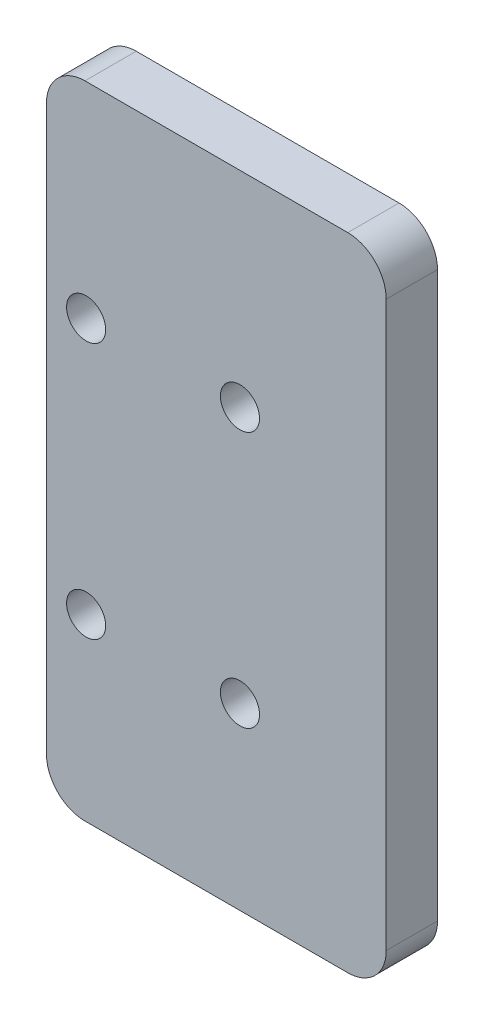
ISO-10303-21;
HEADER;
FILE_DESCRIPTION(('STEP AP214'),'2;1');
FILE_NAME('part.step','',(''),(''),'','','');
FILE_SCHEMA(('AUTOMOTIVE_DESIGN { 1 0 10303 214 1 1 1 1 }'));
ENDSEC;
DATA;
#1=APPLICATION_CONTEXT('core data for automotive mechanical design processes');
#2=APPLICATION_PROTOCOL_DEFINITION('international standard','automotive_design',2000,#1);
#3=PRODUCT_CONTEXT('',#1,'mechanical');
#4=PRODUCT('Part','Part','',(#3));
#5=PRODUCT_RELATED_PRODUCT_CATEGORY('part','',(#4));
#6=PRODUCT_DEFINITION_FORMATION('','',#4);
#7=PRODUCT_DEFINITION_CONTEXT('part definition',#1,'design');
#8=PRODUCT_DEFINITION('design','',#6,#7);
#9=PRODUCT_DEFINITION_SHAPE('','',#8);
#10=(LENGTH_UNIT() NAMED_UNIT(*) SI_UNIT(.MILLI.,.METRE.));
#11=(NAMED_UNIT(*) PLANE_ANGLE_UNIT() SI_UNIT($,.RADIAN.));
#12=(NAMED_UNIT(*) SI_UNIT($,.STERADIAN.) SOLID_ANGLE_UNIT());
#13=UNCERTAINTY_MEASURE_WITH_UNIT(LENGTH_MEASURE(1.E-05),#10,'distance_accuracy_value','');
#14=(GEOMETRIC_REPRESENTATION_CONTEXT(3) GLOBAL_UNCERTAINTY_ASSIGNED_CONTEXT((#13)) GLOBAL_UNIT_ASSIGNED_CONTEXT((#10,
#11,#12)) REPRESENTATION_CONTEXT('',''));
#15=CARTESIAN_POINT('',(0.,0.,0.));
#16=DIRECTION('',(0.,0.,1.));
#17=DIRECTION('',(1.,0.,0.));
#18=AXIS2_PLACEMENT_3D('',#15,#16,#17);
#19=CARTESIAN_POINT('',(13.25,-25.,4.));
#20=DIRECTION('',(-1.,0.,0.));
#21=DIRECTION('',(0.,0.,1.));
#22=AXIS2_PLACEMENT_3D('',#19,#20,#21);
#23=PLANE('',#22);
#24=DIRECTION('',(0.,1.,0.));
#25=VECTOR('',#24,1.);
#26=CARTESIAN_POINT('',(13.25,-25.,4.));
#27=LINE('',#26,#25);
#28=CARTESIAN_POINT('',(13.25,-22.,4.));
#29=VERTEX_POINT('',#28);
#30=CARTESIAN_POINT('',(13.25,22.,4.));
#31=VERTEX_POINT('',#30);
#32=EDGE_CURVE('E121',#29,#31,#27,.T.);
#33=ORIENTED_EDGE('',*,*,#32,.F.);
#34=DIRECTION('',(0.,0.,-1.));
#35=VECTOR('',#34,1.);
#36=CARTESIAN_POINT('',(13.25,-22.,4.));
#37=LINE('',#36,#35);
#38=CARTESIAN_POINT('',(13.25,-22.,0.));
#39=VERTEX_POINT('',#38);
#40=EDGE_CURVE('E106',#29,#39,#37,.T.);
#41=ORIENTED_EDGE('',*,*,#40,.T.);
#42=DIRECTION('',(0.,1.,0.));
#43=VECTOR('',#42,1.);
#44=CARTESIAN_POINT('',(13.25,-25.,0.));
#45=LINE('',#44,#43);
#46=CARTESIAN_POINT('',(13.25,22.,0.));
#47=VERTEX_POINT('',#46);
#48=EDGE_CURVE('E118',#39,#47,#45,.T.);
#49=ORIENTED_EDGE('',*,*,#48,.T.);
#50=DIRECTION('',(0.,0.,-1.));
#51=VECTOR('',#50,1.);
#52=CARTESIAN_POINT('',(13.25,22.,4.));
#53=LINE('',#52,#51);
#54=EDGE_CURVE('E123',#47,#31,#53,.F.);
#55=ORIENTED_EDGE('',*,*,#54,.T.);
#56=EDGE_LOOP('',(#33,#41,#49,#55));
#57=FACE_BOUND('',#56,.T.);
#58=ADVANCED_FACE('F36',(#57),#23,.F.);
#59=CARTESIAN_POINT('',(-13.25,25.,4.));
#60=DIRECTION('',(0.,-1.,0.));
#61=DIRECTION('',(0.,0.,-1.));
#62=AXIS2_PLACEMENT_3D('',#59,#60,#61);
#63=PLANE('',#62);
#64=DIRECTION('',(-1.,0.,0.));
#65=VECTOR('',#64,1.);
#66=CARTESIAN_POINT('',(-13.25,25.,0.));
#67=LINE('',#66,#65);
#68=CARTESIAN_POINT('',(10.25,25.,0.));
#69=VERTEX_POINT('',#68);
#70=CARTESIAN_POINT('',(-10.25,25.,0.));
#71=VERTEX_POINT('',#70);
#72=EDGE_CURVE('E127',#69,#71,#67,.T.);
#73=ORIENTED_EDGE('',*,*,#72,.T.);
#74=DIRECTION('',(0.,0.,-1.));
#75=VECTOR('',#74,1.);
#76=CARTESIAN_POINT('',(-10.25,25.,4.));
#77=LINE('',#76,#75);
#78=CARTESIAN_POINT('',(-10.25,25.,4.));
#79=VERTEX_POINT('',#78);
#80=EDGE_CURVE('E11',#71,#79,#77,.F.);
#81=ORIENTED_EDGE('',*,*,#80,.T.);
#82=DIRECTION('',(-1.,0.,0.));
#83=VECTOR('',#82,1.);
#84=CARTESIAN_POINT('',(-13.25,25.,4.));
#85=LINE('',#84,#83);
#86=CARTESIAN_POINT('',(10.25,25.,4.));
#87=VERTEX_POINT('',#86);
#88=EDGE_CURVE('E167',#87,#79,#85,.T.);
#89=ORIENTED_EDGE('',*,*,#88,.F.);
#90=DIRECTION('',(0.,0.,-1.));
#91=VECTOR('',#90,1.);
#92=CARTESIAN_POINT('',(10.25,25.,4.));
#93=LINE('',#92,#91);
#94=EDGE_CURVE('E44',#87,#69,#93,.T.);
#95=ORIENTED_EDGE('',*,*,#94,.T.);
#96=EDGE_LOOP('',(#73,#81,#89,#95));
#97=FACE_BOUND('',#96,.T.);
#98=ADVANCED_FACE('F165',(#97),#63,.F.);
#99=CARTESIAN_POINT('',(-13.25,-25.,4.));
#100=DIRECTION('',(1.,0.,0.));
#101=DIRECTION('',(0.,0.,-1.));
#102=AXIS2_PLACEMENT_3D('',#99,#100,#101);
#103=PLANE('',#102);
#104=DIRECTION('',(0.,-1.,0.));
#105=VECTOR('',#104,1.);
#106=CARTESIAN_POINT('',(-13.25,-25.,0.));
#107=LINE('',#106,#105);
#108=CARTESIAN_POINT('',(-13.25,22.,0.));
#109=VERTEX_POINT('',#108);
#110=CARTESIAN_POINT('',(-13.25,-22.,0.));
#111=VERTEX_POINT('',#110);
#112=EDGE_CURVE('E131',#109,#111,#107,.T.);
#113=ORIENTED_EDGE('',*,*,#112,.T.);
#114=DIRECTION('',(0.,0.,-1.));
#115=VECTOR('',#114,1.);
#116=CARTESIAN_POINT('',(-13.25,-22.,4.));
#117=LINE('',#116,#115);
#118=CARTESIAN_POINT('',(-13.25,-22.,4.));
#119=VERTEX_POINT('',#118);
#120=EDGE_CURVE('E51',#111,#119,#117,.F.);
#121=ORIENTED_EDGE('',*,*,#120,.T.);
#122=DIRECTION('',(0.,-1.,0.));
#123=VECTOR('',#122,1.);
#124=CARTESIAN_POINT('',(-13.25,-25.,4.));
#125=LINE('',#124,#123);
#126=CARTESIAN_POINT('',(-13.25,22.,4.));
#127=VERTEX_POINT('',#126);
#128=EDGE_CURVE('E175',#127,#119,#125,.T.);
#129=ORIENTED_EDGE('',*,*,#128,.F.);
#130=DIRECTION('',(0.,0.,-1.));
#131=VECTOR('',#130,1.);
#132=CARTESIAN_POINT('',(-13.25,22.,4.));
#133=LINE('',#132,#131);
#134=EDGE_CURVE('E158',#127,#109,#133,.T.);
#135=ORIENTED_EDGE('',*,*,#134,.T.);
#136=EDGE_LOOP('',(#113,#121,#129,#135));
#137=FACE_BOUND('',#136,.T.);
#138=ADVANCED_FACE('F174',(#137),#103,.F.);
#139=CARTESIAN_POINT('',(-13.25,-25.,4.));
#140=DIRECTION('',(0.,1.,0.));
#141=DIRECTION('',(0.,0.,1.));
#142=AXIS2_PLACEMENT_3D('',#139,#140,#141);
#143=PLANE('',#142);
#144=DIRECTION('',(1.,0.,0.));
#145=VECTOR('',#144,1.);
#146=CARTESIAN_POINT('',(-13.25,-25.,0.));
#147=LINE('',#146,#145);
#148=CARTESIAN_POINT('',(-10.25,-25.,0.));
#149=VERTEX_POINT('',#148);
#150=CARTESIAN_POINT('',(10.25,-25.,0.));
#151=VERTEX_POINT('',#150);
#152=EDGE_CURVE('E141',#149,#151,#147,.T.);
#153=ORIENTED_EDGE('',*,*,#152,.T.);
#154=DIRECTION('',(0.,0.,-1.));
#155=VECTOR('',#154,1.);
#156=CARTESIAN_POINT('',(10.25,-25.,4.));
#157=LINE('',#156,#155);
#158=CARTESIAN_POINT('',(10.25,-25.,4.));
#159=VERTEX_POINT('',#158);
#160=EDGE_CURVE('E107',#151,#159,#157,.F.);
#161=ORIENTED_EDGE('',*,*,#160,.T.);
#162=DIRECTION('',(1.,0.,0.));
#163=VECTOR('',#162,1.);
#164=CARTESIAN_POINT('',(-13.25,-25.,4.));
#165=LINE('',#164,#163);
#166=CARTESIAN_POINT('',(-10.25,-25.,4.));
#167=VERTEX_POINT('',#166);
#168=EDGE_CURVE('E137',#167,#159,#165,.T.);
#169=ORIENTED_EDGE('',*,*,#168,.F.);
#170=DIRECTION('',(0.,0.,-1.));
#171=VECTOR('',#170,1.);
#172=CARTESIAN_POINT('',(-10.25,-25.,4.));
#173=LINE('',#172,#171);
#174=EDGE_CURVE('E112',#167,#149,#173,.T.);
#175=ORIENTED_EDGE('',*,*,#174,.T.);
#176=EDGE_LOOP('',(#153,#161,#169,#175));
#177=FACE_BOUND('',#176,.T.);
#178=ADVANCED_FACE('F215',(#177),#143,.F.);
#179=CARTESIAN_POINT('',(0.,0.,4.));
#180=DIRECTION('',(0.,0.,-1.));
#181=DIRECTION('',(-1.,0.,0.));
#182=AXIS2_PLACEMENT_3D('',#179,#180,#181);
#183=PLANE('',#182);
#184=CARTESIAN_POINT('',(1.84135955634475,8.99999999999956,4.));
#185=DIRECTION('',(0.,0.,1.));
#186=DIRECTION('',(1.,0.,0.));
#187=AXIS2_PLACEMENT_3D('',#184,#185,#186);
#188=CIRCLE('',#187,1.525);
#189=CARTESIAN_POINT('',(3.36635955634475,8.99999999999956,4.));
#190=VERTEX_POINT('',#189);
#191=EDGE_CURVE('E191',#190,#190,#188,.T.);
#192=ORIENTED_EDGE('',*,*,#191,.F.);
#193=EDGE_LOOP('',(#192));
#194=FACE_BOUND('',#193,.T.);
#195=CARTESIAN_POINT('',(-10.1586404436553,-11.0000000000004,4.));
#196=DIRECTION('',(0.,0.,1.));
#197=DIRECTION('',(1.,0.,0.));
#198=AXIS2_PLACEMENT_3D('',#195,#196,#197);
#199=CIRCLE('',#198,1.525);
#200=CARTESIAN_POINT('',(-8.63364044365525,-11.0000000000004,4.));
#201=VERTEX_POINT('',#200);
#202=EDGE_CURVE('E184',#201,#201,#199,.T.);
#203=ORIENTED_EDGE('',*,*,#202,.F.);
#204=EDGE_LOOP('',(#203));
#205=FACE_BOUND('',#204,.T.);
#206=CARTESIAN_POINT('',(1.84135955634475,-11.0000000000004,4.));
#207=DIRECTION('',(0.,0.,1.));
#208=DIRECTION('',(1.,0.,0.));
#209=AXIS2_PLACEMENT_3D('',#206,#207,#208);
#210=CIRCLE('',#209,1.525);
#211=CARTESIAN_POINT('',(3.36635955634475,-11.0000000000004,4.));
#212=VERTEX_POINT('',#211);
#213=EDGE_CURVE('E196',#212,#212,#210,.T.);
#214=ORIENTED_EDGE('',*,*,#213,.F.);
#215=EDGE_LOOP('',(#214));
#216=FACE_BOUND('',#215,.T.);
#217=CARTESIAN_POINT('',(-10.1586404436553,8.99999999999953,4.));
#218=DIRECTION('',(0.,0.,1.));
#219=DIRECTION('',(1.,0.,0.));
#220=AXIS2_PLACEMENT_3D('',#217,#218,#219);
#221=CIRCLE('',#220,1.525);
#222=CARTESIAN_POINT('',(-8.63364044365525,8.99999999999953,4.));
#223=VERTEX_POINT('',#222);
#224=EDGE_CURVE('E134',#223,#223,#221,.T.);
#225=ORIENTED_EDGE('',*,*,#224,.F.);
#226=EDGE_LOOP('',(#225));
#227=FACE_BOUND('',#226,.T.);
#228=ORIENTED_EDGE('',*,*,#168,.T.);
#229=CARTESIAN_POINT('',(10.25,-22.,4.));
#230=DIRECTION('',(0.,0.,-1.));
#231=DIRECTION('',(-1.,0.,0.));
#232=AXIS2_PLACEMENT_3D('',#229,#230,#231);
#233=CIRCLE('',#232,3.);
#234=EDGE_CURVE('E156',#159,#29,#233,.F.);
#235=ORIENTED_EDGE('',*,*,#234,.T.);
#236=ORIENTED_EDGE('',*,*,#32,.T.);
#237=CARTESIAN_POINT('',(10.25,22.,4.));
#238=DIRECTION('',(0.,0.,-1.));
#239=DIRECTION('',(-1.,0.,0.));
#240=AXIS2_PLACEMENT_3D('',#237,#238,#239);
#241=CIRCLE('',#240,3.);
#242=EDGE_CURVE('E151',#31,#87,#241,.F.);
#243=ORIENTED_EDGE('',*,*,#242,.T.);
#244=ORIENTED_EDGE('',*,*,#88,.T.);
#245=CARTESIAN_POINT('',(-10.25,22.,4.));
#246=DIRECTION('',(0.,0.,-1.));
#247=DIRECTION('',(-1.,0.,0.));
#248=AXIS2_PLACEMENT_3D('',#245,#246,#247);
#249=CIRCLE('',#248,3.);
#250=EDGE_CURVE('E58',#79,#127,#249,.F.);
#251=ORIENTED_EDGE('',*,*,#250,.T.);
#252=ORIENTED_EDGE('',*,*,#128,.T.);
#253=CARTESIAN_POINT('',(-10.25,-22.,4.));
#254=DIRECTION('',(0.,0.,-1.));
#255=DIRECTION('',(-1.,0.,0.));
#256=AXIS2_PLACEMENT_3D('',#253,#254,#255);
#257=CIRCLE('',#256,3.);
#258=EDGE_CURVE('E154',#119,#167,#257,.F.);
#259=ORIENTED_EDGE('',*,*,#258,.T.);
#260=EDGE_LOOP('',(#228,#235,#236,#243,#244,#251,#252,#259));
#261=FACE_BOUND('',#260,.T.);
#262=ADVANCED_FACE('F212',(#194,#205,#216,#227,#261),#183,.F.);
#263=CARTESIAN_POINT('',(0.,0.,0.));
#264=DIRECTION('',(0.,0.,-1.));
#265=DIRECTION('',(-1.,0.,0.));
#266=AXIS2_PLACEMENT_3D('',#263,#264,#265);
#267=PLANE('',#266);
#268=CARTESIAN_POINT('',(1.84135955634475,8.99999999999956,0.));
#269=DIRECTION('',(0.,0.,1.));
#270=DIRECTION('',(1.,0.,0.));
#271=AXIS2_PLACEMENT_3D('',#268,#269,#270);
#272=CIRCLE('',#271,1.525);
#273=CARTESIAN_POINT('',(3.36635955634475,8.99999999999956,0.));
#274=VERTEX_POINT('',#273);
#275=EDGE_CURVE('E182',#274,#274,#272,.T.);
#276=ORIENTED_EDGE('',*,*,#275,.T.);
#277=EDGE_LOOP('',(#276));
#278=FACE_BOUND('',#277,.T.);
#279=CARTESIAN_POINT('',(-10.1586404436553,-11.0000000000004,0.));
#280=DIRECTION('',(0.,0.,1.));
#281=DIRECTION('',(1.,0.,0.));
#282=AXIS2_PLACEMENT_3D('',#279,#280,#281);
#283=CIRCLE('',#282,1.525);
#284=CARTESIAN_POINT('',(-8.63364044365525,-11.0000000000004,0.));
#285=VERTEX_POINT('',#284);
#286=EDGE_CURVE('E187',#285,#285,#283,.T.);
#287=ORIENTED_EDGE('',*,*,#286,.T.);
#288=EDGE_LOOP('',(#287));
#289=FACE_BOUND('',#288,.T.);
#290=CARTESIAN_POINT('',(1.84135955634475,-11.0000000000004,0.));
#291=DIRECTION('',(0.,0.,1.));
#292=DIRECTION('',(1.,0.,0.));
#293=AXIS2_PLACEMENT_3D('',#290,#291,#292);
#294=CIRCLE('',#293,1.525);
#295=CARTESIAN_POINT('',(3.36635955634475,-11.0000000000004,0.));
#296=VERTEX_POINT('',#295);
#297=EDGE_CURVE('E188',#296,#296,#294,.T.);
#298=ORIENTED_EDGE('',*,*,#297,.T.);
#299=EDGE_LOOP('',(#298));
#300=FACE_BOUND('',#299,.T.);
#301=CARTESIAN_POINT('',(-10.1586404436553,8.99999999999953,0.));
#302=DIRECTION('',(0.,0.,1.));
#303=DIRECTION('',(1.,0.,0.));
#304=AXIS2_PLACEMENT_3D('',#301,#302,#303);
#305=CIRCLE('',#304,1.525);
#306=CARTESIAN_POINT('',(-8.63364044365525,8.99999999999953,0.));
#307=VERTEX_POINT('',#306);
#308=EDGE_CURVE('E128',#307,#307,#305,.T.);
#309=ORIENTED_EDGE('',*,*,#308,.T.);
#310=EDGE_LOOP('',(#309));
#311=FACE_BOUND('',#310,.T.);
#312=ORIENTED_EDGE('',*,*,#48,.F.);
#313=CARTESIAN_POINT('',(10.25,-22.,0.));
#314=DIRECTION('',(0.,0.,-1.));
#315=DIRECTION('',(-1.,0.,0.));
#316=AXIS2_PLACEMENT_3D('',#313,#314,#315);
#317=CIRCLE('',#316,3.);
#318=EDGE_CURVE('E102',#39,#151,#317,.T.);
#319=ORIENTED_EDGE('',*,*,#318,.T.);
#320=ORIENTED_EDGE('',*,*,#152,.F.);
#321=CARTESIAN_POINT('',(-10.25,-22.,0.));
#322=DIRECTION('',(0.,0.,-1.));
#323=DIRECTION('',(-1.,0.,0.));
#324=AXIS2_PLACEMENT_3D('',#321,#322,#323);
#325=CIRCLE('',#324,3.);
#326=EDGE_CURVE('E113',#149,#111,#325,.T.);
#327=ORIENTED_EDGE('',*,*,#326,.T.);
#328=ORIENTED_EDGE('',*,*,#112,.F.);
#329=CARTESIAN_POINT('',(-10.25,22.,0.));
#330=DIRECTION('',(0.,0.,-1.));
#331=DIRECTION('',(-1.,0.,0.));
#332=AXIS2_PLACEMENT_3D('',#329,#330,#331);
#333=CIRCLE('',#332,3.);
#334=EDGE_CURVE('E145',#109,#71,#333,.T.);
#335=ORIENTED_EDGE('',*,*,#334,.T.);
#336=ORIENTED_EDGE('',*,*,#72,.F.);
#337=CARTESIAN_POINT('',(10.25,22.,0.));
#338=DIRECTION('',(0.,0.,-1.));
#339=DIRECTION('',(-1.,0.,0.));
#340=AXIS2_PLACEMENT_3D('',#337,#338,#339);
#341=CIRCLE('',#340,3.);
#342=EDGE_CURVE('E122',#69,#47,#341,.T.);
#343=ORIENTED_EDGE('',*,*,#342,.T.);
#344=EDGE_LOOP('',(#312,#319,#320,#327,#328,#335,#336,#343));
#345=FACE_BOUND('',#344,.T.);
#346=ADVANCED_FACE('F125',(#278,#289,#300,#311,#345),#267,.T.);
#347=CARTESIAN_POINT('',(-10.1586404436553,8.99999999999953,0.));
#348=DIRECTION('',(0.,0.,1.));
#349=DIRECTION('',(1.,0.,0.));
#350=AXIS2_PLACEMENT_3D('',#347,#348,#349);
#351=CYLINDRICAL_SURFACE('',#350,1.525);
#352=ORIENTED_EDGE('',*,*,#308,.F.);
#353=EDGE_LOOP('',(#352));
#354=FACE_BOUND('',#353,.T.);
#355=ORIENTED_EDGE('',*,*,#224,.T.);
#356=EDGE_LOOP('',(#355));
#357=FACE_BOUND('',#356,.T.);
#358=ADVANCED_FACE('F208',(#354,#357),#351,.F.);
#359=CARTESIAN_POINT('',(1.84135955634475,-11.0000000000004,0.));
#360=DIRECTION('',(0.,0.,1.));
#361=DIRECTION('',(1.,0.,0.));
#362=AXIS2_PLACEMENT_3D('',#359,#360,#361);
#363=CYLINDRICAL_SURFACE('',#362,1.525);
#364=ORIENTED_EDGE('',*,*,#297,.F.);
#365=EDGE_LOOP('',(#364));
#366=FACE_BOUND('',#365,.T.);
#367=ORIENTED_EDGE('',*,*,#213,.T.);
#368=EDGE_LOOP('',(#367));
#369=FACE_BOUND('',#368,.T.);
#370=ADVANCED_FACE('F204',(#366,#369),#363,.F.);
#371=CARTESIAN_POINT('',(-10.1586404436553,-11.0000000000004,0.));
#372=DIRECTION('',(0.,0.,1.));
#373=DIRECTION('',(1.,0.,0.));
#374=AXIS2_PLACEMENT_3D('',#371,#372,#373);
#375=CYLINDRICAL_SURFACE('',#374,1.525);
#376=ORIENTED_EDGE('',*,*,#286,.F.);
#377=EDGE_LOOP('',(#376));
#378=FACE_BOUND('',#377,.T.);
#379=ORIENTED_EDGE('',*,*,#202,.T.);
#380=EDGE_LOOP('',(#379));
#381=FACE_BOUND('',#380,.T.);
#382=ADVANCED_FACE('F207',(#378,#381),#375,.F.);
#383=CARTESIAN_POINT('',(1.84135955634475,8.99999999999956,0.));
#384=DIRECTION('',(0.,0.,1.));
#385=DIRECTION('',(1.,0.,0.));
#386=AXIS2_PLACEMENT_3D('',#383,#384,#385);
#387=CYLINDRICAL_SURFACE('',#386,1.525);
#388=ORIENTED_EDGE('',*,*,#275,.F.);
#389=EDGE_LOOP('',(#388));
#390=FACE_BOUND('',#389,.T.);
#391=ORIENTED_EDGE('',*,*,#191,.T.);
#392=EDGE_LOOP('',(#391));
#393=FACE_BOUND('',#392,.T.);
#394=ADVANCED_FACE('F230',(#390,#393),#387,.F.);
#395=CARTESIAN_POINT('',(10.25,-22.,4.));
#396=DIRECTION('',(0.,0.,-1.));
#397=DIRECTION('',(-1.,0.,0.));
#398=AXIS2_PLACEMENT_3D('',#395,#396,#397);
#399=CYLINDRICAL_SURFACE('',#398,3.);
#400=ORIENTED_EDGE('',*,*,#234,.F.);
#401=ORIENTED_EDGE('',*,*,#160,.F.);
#402=ORIENTED_EDGE('',*,*,#318,.F.);
#403=ORIENTED_EDGE('',*,*,#40,.F.);
#404=EDGE_LOOP('',(#400,#401,#402,#403));
#405=FACE_BOUND('',#404,.T.);
#406=ADVANCED_FACE('F105',(#405),#399,.T.);
#407=CARTESIAN_POINT('',(-10.25,-22.,4.));
#408=DIRECTION('',(0.,0.,-1.));
#409=DIRECTION('',(-1.,0.,0.));
#410=AXIS2_PLACEMENT_3D('',#407,#408,#409);
#411=CYLINDRICAL_SURFACE('',#410,3.);
#412=ORIENTED_EDGE('',*,*,#258,.F.);
#413=ORIENTED_EDGE('',*,*,#120,.F.);
#414=ORIENTED_EDGE('',*,*,#326,.F.);
#415=ORIENTED_EDGE('',*,*,#174,.F.);
#416=EDGE_LOOP('',(#412,#413,#414,#415));
#417=FACE_BOUND('',#416,.T.);
#418=ADVANCED_FACE('F223',(#417),#411,.T.);
#419=CARTESIAN_POINT('',(-10.25,22.,4.));
#420=DIRECTION('',(0.,0.,-1.));
#421=DIRECTION('',(-1.,0.,0.));
#422=AXIS2_PLACEMENT_3D('',#419,#420,#421);
#423=CYLINDRICAL_SURFACE('',#422,3.);
#424=ORIENTED_EDGE('',*,*,#250,.F.);
#425=ORIENTED_EDGE('',*,*,#80,.F.);
#426=ORIENTED_EDGE('',*,*,#334,.F.);
#427=ORIENTED_EDGE('',*,*,#134,.F.);
#428=EDGE_LOOP('',(#424,#425,#426,#427));
#429=FACE_BOUND('',#428,.T.);
#430=ADVANCED_FACE('F173',(#429),#423,.T.);
#431=CARTESIAN_POINT('',(10.25,22.,4.));
#432=DIRECTION('',(0.,0.,-1.));
#433=DIRECTION('',(-1.,0.,0.));
#434=AXIS2_PLACEMENT_3D('',#431,#432,#433);
#435=CYLINDRICAL_SURFACE('',#434,3.);
#436=ORIENTED_EDGE('',*,*,#242,.F.);
#437=ORIENTED_EDGE('',*,*,#54,.F.);
#438=ORIENTED_EDGE('',*,*,#342,.F.);
#439=ORIENTED_EDGE('',*,*,#94,.F.);
#440=EDGE_LOOP('',(#436,#437,#438,#439));
#441=FACE_BOUND('',#440,.T.);
#442=ADVANCED_FACE('F38',(#441),#435,.T.);
#443=CLOSED_SHELL('',(#58,#98,#138,#178,#262,#346,#358,#370,#382,#394,#406,#418,#430,#442));
#444=MANIFOLD_SOLID_BREP('B2',#443);
#445=ADVANCED_BREP_SHAPE_REPRESENTATION('',(#18,#444),#14);
#446=SHAPE_DEFINITION_REPRESENTATION(#9,#445);
ENDSEC;
END-ISO-10303-21;
